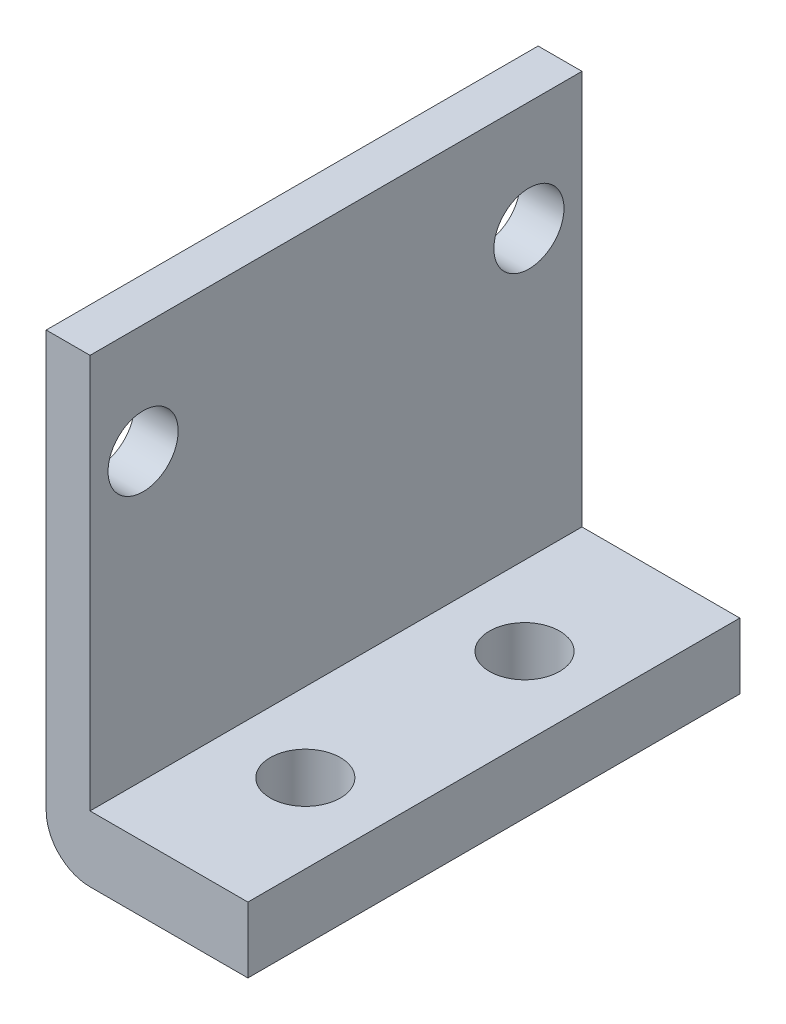
ISO-10303-21;
HEADER;
FILE_DESCRIPTION(('STEP AP214'),'2;1');
FILE_NAME('part.step','',(''),(''),'','','');
FILE_SCHEMA(('AUTOMOTIVE_DESIGN { 1 0 10303 214 1 1 1 1 }'));
ENDSEC;
DATA;
#1=APPLICATION_CONTEXT('core data for automotive mechanical design processes');
#2=APPLICATION_PROTOCOL_DEFINITION('international standard','automotive_design',2000,#1);
#3=PRODUCT_CONTEXT('',#1,'mechanical');
#4=PRODUCT('Part','Part','',(#3));
#5=PRODUCT_RELATED_PRODUCT_CATEGORY('part','',(#4));
#6=PRODUCT_DEFINITION_FORMATION('','',#4);
#7=PRODUCT_DEFINITION_CONTEXT('part definition',#1,'design');
#8=PRODUCT_DEFINITION('design','',#6,#7);
#9=PRODUCT_DEFINITION_SHAPE('','',#8);
#10=(LENGTH_UNIT() NAMED_UNIT(*) SI_UNIT(.MILLI.,.METRE.));
#11=(NAMED_UNIT(*) PLANE_ANGLE_UNIT() SI_UNIT($,.RADIAN.));
#12=(NAMED_UNIT(*) SI_UNIT($,.STERADIAN.) SOLID_ANGLE_UNIT());
#13=UNCERTAINTY_MEASURE_WITH_UNIT(LENGTH_MEASURE(1.E-05),#10,'distance_accuracy_value','');
#14=(GEOMETRIC_REPRESENTATION_CONTEXT(3) GLOBAL_UNCERTAINTY_ASSIGNED_CONTEXT((#13)) GLOBAL_UNIT_ASSIGNED_CONTEXT((#10,
#11,#12)) REPRESENTATION_CONTEXT('',''));
#15=CARTESIAN_POINT('',(0.,0.,0.));
#16=DIRECTION('',(0.,0.,1.));
#17=DIRECTION('',(1.,0.,0.));
#18=AXIS2_PLACEMENT_3D('',#15,#16,#17);
#19=CARTESIAN_POINT('',(0.,3.,0.));
#20=DIRECTION('',(0.,-1.,0.));
#21=DIRECTION('',(0.,0.,-1.));
#22=AXIS2_PLACEMENT_3D('',#19,#20,#21);
#23=PLANE('',#22);
#24=DIRECTION('',(-1.,0.,0.));
#25=VECTOR('',#24,1.);
#26=CARTESIAN_POINT('',(0.,3.,-22.44));
#27=LINE('',#26,#25);
#28=CARTESIAN_POINT('',(9.20000000000001,3.,-22.44));
#29=VERTEX_POINT('',#28);
#30=CARTESIAN_POINT('',(2.,3.,-22.44));
#31=VERTEX_POINT('',#30);
#32=EDGE_CURVE('E160',#29,#31,#27,.T.);
#33=ORIENTED_EDGE('',*,*,#32,.T.);
#34=DIRECTION('',(0.,0.,1.));
#35=VECTOR('',#34,1.);
#36=CARTESIAN_POINT('',(2.,3.,-22.44));
#37=LINE('',#36,#35);
#38=CARTESIAN_POINT('',(2.,3.,0.));
#39=VERTEX_POINT('',#38);
#40=EDGE_CURVE('E109',#31,#39,#37,.T.);
#41=ORIENTED_EDGE('',*,*,#40,.T.);
#42=DIRECTION('',(1.,0.,0.));
#43=VECTOR('',#42,1.);
#44=CARTESIAN_POINT('',(0.,3.,0.));
#45=LINE('',#44,#43);
#46=CARTESIAN_POINT('',(9.20000000000001,3.,0.));
#47=VERTEX_POINT('',#46);
#48=EDGE_CURVE('E115',#39,#47,#45,.T.);
#49=ORIENTED_EDGE('',*,*,#48,.T.);
#50=DIRECTION('',(0.,0.,-1.));
#51=VECTOR('',#50,1.);
#52=CARTESIAN_POINT('',(9.20000000000001,3.,0.));
#53=LINE('',#52,#51);
#54=EDGE_CURVE('E156',#47,#29,#53,.T.);
#55=ORIENTED_EDGE('',*,*,#54,.T.);
#56=EDGE_LOOP('',(#33,#41,#49,#55));
#57=FACE_BOUND('',#56,.T.);
#58=CARTESIAN_POINT('',(5.6,3.,-16.22));
#59=DIRECTION('',(0.,1.,0.));
#60=DIRECTION('',(0.,0.,1.));
#61=AXIS2_PLACEMENT_3D('',#58,#59,#60);
#62=CIRCLE('',#61,1.6);
#63=CARTESIAN_POINT('',(5.6,3.,-14.62));
#64=VERTEX_POINT('',#63);
#65=EDGE_CURVE('E146',#64,#64,#62,.T.);
#66=ORIENTED_EDGE('',*,*,#65,.F.);
#67=EDGE_LOOP('',(#66));
#68=FACE_BOUND('',#67,.T.);
#69=CARTESIAN_POINT('',(5.6,3.,-6.22));
#70=DIRECTION('',(0.,1.,0.));
#71=DIRECTION('',(0.,0.,1.));
#72=AXIS2_PLACEMENT_3D('',#69,#70,#71);
#73=CIRCLE('',#72,1.6);
#74=CARTESIAN_POINT('',(5.6,3.,-4.62));
#75=VERTEX_POINT('',#74);
#76=EDGE_CURVE('E138',#75,#75,#73,.T.);
#77=ORIENTED_EDGE('',*,*,#76,.F.);
#78=EDGE_LOOP('',(#77));
#79=FACE_BOUND('',#78,.T.);
#80=ADVANCED_FACE('F39',(#57,#68,#79),#23,.F.);
#81=CARTESIAN_POINT('',(0.,0.,0.));
#82=DIRECTION('',(0.,-1.,0.));
#83=DIRECTION('',(0.,0.,-1.));
#84=AXIS2_PLACEMENT_3D('',#81,#82,#83);
#85=PLANE('',#84);
#86=CARTESIAN_POINT('',(5.6,0.,-16.22));
#87=DIRECTION('',(0.,1.,0.));
#88=DIRECTION('',(0.,0.,1.));
#89=AXIS2_PLACEMENT_3D('',#86,#87,#88);
#90=CIRCLE('',#89,1.6);
#91=CARTESIAN_POINT('',(5.6,0.,-14.62));
#92=VERTEX_POINT('',#91);
#93=EDGE_CURVE('E142',#92,#92,#90,.T.);
#94=ORIENTED_EDGE('',*,*,#93,.T.);
#95=EDGE_LOOP('',(#94));
#96=FACE_BOUND('',#95,.T.);
#97=DIRECTION('',(1.,0.,0.));
#98=VECTOR('',#97,1.);
#99=CARTESIAN_POINT('',(0.,0.,0.));
#100=LINE('',#99,#98);
#101=CARTESIAN_POINT('',(2.,0.,0.));
#102=VERTEX_POINT('',#101);
#103=CARTESIAN_POINT('',(9.20000000000001,0.,0.));
#104=VERTEX_POINT('',#103);
#105=EDGE_CURVE('E150',#102,#104,#100,.T.);
#106=ORIENTED_EDGE('',*,*,#105,.F.);
#107=DIRECTION('',(0.,0.,1.));
#108=VECTOR('',#107,1.);
#109=CARTESIAN_POINT('',(2.,0.,-22.44));
#110=LINE('',#109,#108);
#111=CARTESIAN_POINT('',(2.,0.,-22.44));
#112=VERTEX_POINT('',#111);
#113=EDGE_CURVE('E48',#102,#112,#110,.F.);
#114=ORIENTED_EDGE('',*,*,#113,.T.);
#115=DIRECTION('',(-1.,0.,0.));
#116=VECTOR('',#115,1.);
#117=CARTESIAN_POINT('',(0.,0.,-22.44));
#118=LINE('',#117,#116);
#119=CARTESIAN_POINT('',(9.20000000000001,0.,-22.44));
#120=VERTEX_POINT('',#119);
#121=EDGE_CURVE('E157',#120,#112,#118,.T.);
#122=ORIENTED_EDGE('',*,*,#121,.F.);
#123=DIRECTION('',(0.,0.,-1.));
#124=VECTOR('',#123,1.);
#125=CARTESIAN_POINT('',(9.20000000000001,0.,0.));
#126=LINE('',#125,#124);
#127=EDGE_CURVE('E167',#104,#120,#126,.T.);
#128=ORIENTED_EDGE('',*,*,#127,.F.);
#129=EDGE_LOOP('',(#106,#114,#122,#128));
#130=FACE_BOUND('',#129,.T.);
#131=CARTESIAN_POINT('',(5.6,0.,-6.22));
#132=DIRECTION('',(0.,1.,0.));
#133=DIRECTION('',(0.,0.,1.));
#134=AXIS2_PLACEMENT_3D('',#131,#132,#133);
#135=CIRCLE('',#134,1.6);
#136=CARTESIAN_POINT('',(5.6,0.,-4.62));
#137=VERTEX_POINT('',#136);
#138=EDGE_CURVE('E120',#137,#137,#135,.T.);
#139=ORIENTED_EDGE('',*,*,#138,.T.);
#140=EDGE_LOOP('',(#139));
#141=FACE_BOUND('',#140,.T.);
#142=ADVANCED_FACE('F202',(#96,#130,#141),#85,.T.);
#143=CARTESIAN_POINT('',(0.,3.,0.));
#144=DIRECTION('',(1.,0.,0.));
#145=DIRECTION('',(0.,0.,-1.));
#146=AXIS2_PLACEMENT_3D('',#143,#144,#145);
#147=PLANE('',#146);
#148=CARTESIAN_POINT('',(0.,16.,-2.42000000000001));
#149=DIRECTION('',(1.,0.,0.));
#150=DIRECTION('',(0.,0.,-1.));
#151=AXIS2_PLACEMENT_3D('',#148,#149,#150);
#152=CIRCLE('',#151,1.6);
#153=CARTESIAN_POINT('',(0.,16.,-4.02000000000001));
#154=VERTEX_POINT('',#153);
#155=EDGE_CURVE('E135',#154,#154,#152,.T.);
#156=ORIENTED_EDGE('',*,*,#155,.T.);
#157=EDGE_LOOP('',(#156));
#158=FACE_BOUND('',#157,.T.);
#159=CARTESIAN_POINT('',(0.,16.,-20.02));
#160=DIRECTION('',(1.,0.,0.));
#161=DIRECTION('',(0.,0.,-1.));
#162=AXIS2_PLACEMENT_3D('',#159,#160,#161);
#163=CIRCLE('',#162,1.6);
#164=CARTESIAN_POINT('',(0.,16.,-21.62));
#165=VERTEX_POINT('',#164);
#166=EDGE_CURVE('E343',#165,#165,#163,.T.);
#167=ORIENTED_EDGE('',*,*,#166,.T.);
#168=EDGE_LOOP('',(#167));
#169=FACE_BOUND('',#168,.T.);
#170=DIRECTION('',(0.,-1.,0.));
#171=VECTOR('',#170,1.);
#172=CARTESIAN_POINT('',(0.,3.,-22.44));
#173=LINE('',#172,#171);
#174=CARTESIAN_POINT('',(0.,21.,-22.44));
#175=VERTEX_POINT('',#174);
#176=CARTESIAN_POINT('',(0.,2.,-22.44));
#177=VERTEX_POINT('',#176);
#178=EDGE_CURVE('E164',#175,#177,#173,.T.);
#179=ORIENTED_EDGE('',*,*,#178,.T.);
#180=DIRECTION('',(0.,0.,1.));
#181=VECTOR('',#180,1.);
#182=CARTESIAN_POINT('',(0.,2.,0.));
#183=LINE('',#182,#181);
#184=CARTESIAN_POINT('',(0.,2.,0.));
#185=VERTEX_POINT('',#184);
#186=EDGE_CURVE('E186',#177,#185,#183,.T.);
#187=ORIENTED_EDGE('',*,*,#186,.T.);
#188=DIRECTION('',(0.,-1.,0.));
#189=VECTOR('',#188,1.);
#190=CARTESIAN_POINT('',(0.,3.,0.));
#191=LINE('',#190,#189);
#192=CARTESIAN_POINT('',(0.,21.,0.));
#193=VERTEX_POINT('',#192);
#194=EDGE_CURVE('E183',#193,#185,#191,.T.);
#195=ORIENTED_EDGE('',*,*,#194,.F.);
#196=DIRECTION('',(0.,0.,1.));
#197=VECTOR('',#196,1.);
#198=CARTESIAN_POINT('',(0.,21.,-22.44));
#199=LINE('',#198,#197);
#200=EDGE_CURVE('E107',#175,#193,#199,.T.);
#201=ORIENTED_EDGE('',*,*,#200,.F.);
#202=EDGE_LOOP('',(#179,#187,#195,#201));
#203=FACE_BOUND('',#202,.T.);
#204=ADVANCED_FACE('F194',(#158,#169,#203),#147,.F.);
#205=CARTESIAN_POINT('',(0.,3.,0.));
#206=DIRECTION('',(0.,0.,-1.));
#207=DIRECTION('',(-1.,0.,0.));
#208=AXIS2_PLACEMENT_3D('',#205,#206,#207);
#209=PLANE('',#208);
#210=ORIENTED_EDGE('',*,*,#194,.T.);
#211=CARTESIAN_POINT('',(2.,2.,0.));
#212=DIRECTION('',(0.,0.,-1.));
#213=DIRECTION('',(-1.,0.,0.));
#214=AXIS2_PLACEMENT_3D('',#211,#212,#213);
#215=CIRCLE('',#214,2.);
#216=EDGE_CURVE('E62',#185,#102,#215,.F.);
#217=ORIENTED_EDGE('',*,*,#216,.T.);
#218=ORIENTED_EDGE('',*,*,#105,.T.);
#219=DIRECTION('',(0.,-1.,0.));
#220=VECTOR('',#219,1.);
#221=CARTESIAN_POINT('',(9.20000000000001,3.,0.));
#222=LINE('',#221,#220);
#223=EDGE_CURVE('E179',#47,#104,#222,.T.);
#224=ORIENTED_EDGE('',*,*,#223,.F.);
#225=ORIENTED_EDGE('',*,*,#48,.F.);
#226=DIRECTION('',(0.,-1.,0.));
#227=VECTOR('',#226,1.);
#228=CARTESIAN_POINT('',(2.,21.,0.));
#229=LINE('',#228,#227);
#230=CARTESIAN_POINT('',(2.,21.,0.));
#231=VERTEX_POINT('',#230);
#232=EDGE_CURVE('E112',#231,#39,#229,.T.);
#233=ORIENTED_EDGE('',*,*,#232,.F.);
#234=DIRECTION('',(1.,0.,0.));
#235=VECTOR('',#234,1.);
#236=CARTESIAN_POINT('',(0.,21.,0.));
#237=LINE('',#236,#235);
#238=EDGE_CURVE('E99',#193,#231,#237,.T.);
#239=ORIENTED_EDGE('',*,*,#238,.F.);
#240=EDGE_LOOP('',(#210,#217,#218,#224,#225,#233,#239));
#241=FACE_BOUND('',#240,.T.);
#242=ADVANCED_FACE('F113',(#241),#209,.F.);
#243=CARTESIAN_POINT('',(9.20000000000001,3.,0.));
#244=DIRECTION('',(-1.,0.,0.));
#245=DIRECTION('',(0.,0.,1.));
#246=AXIS2_PLACEMENT_3D('',#243,#244,#245);
#247=PLANE('',#246);
#248=ORIENTED_EDGE('',*,*,#127,.T.);
#249=DIRECTION('',(0.,-1.,0.));
#250=VECTOR('',#249,1.);
#251=CARTESIAN_POINT('',(9.20000000000001,3.,-22.44));
#252=LINE('',#251,#250);
#253=EDGE_CURVE('E175',#29,#120,#252,.T.);
#254=ORIENTED_EDGE('',*,*,#253,.F.);
#255=ORIENTED_EDGE('',*,*,#54,.F.);
#256=ORIENTED_EDGE('',*,*,#223,.T.);
#257=EDGE_LOOP('',(#248,#254,#255,#256));
#258=FACE_BOUND('',#257,.T.);
#259=ADVANCED_FACE('F205',(#258),#247,.F.);
#260=CARTESIAN_POINT('',(0.,3.,-22.44));
#261=DIRECTION('',(0.,0.,1.));
#262=DIRECTION('',(1.,0.,0.));
#263=AXIS2_PLACEMENT_3D('',#260,#261,#262);
#264=PLANE('',#263);
#265=ORIENTED_EDGE('',*,*,#121,.T.);
#266=CARTESIAN_POINT('',(2.,2.,-22.44));
#267=DIRECTION('',(0.,0.,1.));
#268=DIRECTION('',(1.,0.,0.));
#269=AXIS2_PLACEMENT_3D('',#266,#267,#268);
#270=CIRCLE('',#269,2.);
#271=EDGE_CURVE('E11',#112,#177,#270,.F.);
#272=ORIENTED_EDGE('',*,*,#271,.T.);
#273=ORIENTED_EDGE('',*,*,#178,.F.);
#274=DIRECTION('',(1.,0.,0.));
#275=VECTOR('',#274,1.);
#276=CARTESIAN_POINT('',(0.,21.,-22.44));
#277=LINE('',#276,#275);
#278=CARTESIAN_POINT('',(2.,21.,-22.44));
#279=VERTEX_POINT('',#278);
#280=EDGE_CURVE('E125',#175,#279,#277,.T.);
#281=ORIENTED_EDGE('',*,*,#280,.T.);
#282=DIRECTION('',(0.,-1.,0.));
#283=VECTOR('',#282,1.);
#284=CARTESIAN_POINT('',(2.,21.,-22.44));
#285=LINE('',#284,#283);
#286=EDGE_CURVE('E121',#279,#31,#285,.T.);
#287=ORIENTED_EDGE('',*,*,#286,.T.);
#288=ORIENTED_EDGE('',*,*,#32,.F.);
#289=ORIENTED_EDGE('',*,*,#253,.T.);
#290=EDGE_LOOP('',(#265,#272,#273,#281,#287,#288,#289));
#291=FACE_BOUND('',#290,.T.);
#292=ADVANCED_FACE('F198',(#291),#264,.F.);
#293=CARTESIAN_POINT('',(5.6,3.,-16.22));
#294=DIRECTION('',(0.,-1.,0.));
#295=DIRECTION('',(0.,0.,-1.));
#296=AXIS2_PLACEMENT_3D('',#293,#294,#295);
#297=CYLINDRICAL_SURFACE('',#296,1.6);
#298=ORIENTED_EDGE('',*,*,#65,.T.);
#299=EDGE_LOOP('',(#298));
#300=FACE_BOUND('',#299,.T.);
#301=ORIENTED_EDGE('',*,*,#93,.F.);
#302=EDGE_LOOP('',(#301));
#303=FACE_BOUND('',#302,.T.);
#304=ADVANCED_FACE('F218',(#300,#303),#297,.F.);
#305=CARTESIAN_POINT('',(5.6,3.,-6.22));
#306=DIRECTION('',(0.,-1.,0.));
#307=DIRECTION('',(0.,0.,-1.));
#308=AXIS2_PLACEMENT_3D('',#305,#306,#307);
#309=CYLINDRICAL_SURFACE('',#308,1.6);
#310=ORIENTED_EDGE('',*,*,#76,.T.);
#311=EDGE_LOOP('',(#310));
#312=FACE_BOUND('',#311,.T.);
#313=ORIENTED_EDGE('',*,*,#138,.F.);
#314=EDGE_LOOP('',(#313));
#315=FACE_BOUND('',#314,.T.);
#316=ADVANCED_FACE('F215',(#312,#315),#309,.F.);
#317=CARTESIAN_POINT('',(2.,21.,-22.44));
#318=DIRECTION('',(1.,0.,0.));
#319=DIRECTION('',(0.,0.,-1.));
#320=AXIS2_PLACEMENT_3D('',#317,#318,#319);
#321=PLANE('',#320);
#322=CARTESIAN_POINT('',(2.,16.,-2.42000000000001));
#323=DIRECTION('',(1.,0.,0.));
#324=DIRECTION('',(0.,0.,-1.));
#325=AXIS2_PLACEMENT_3D('',#322,#323,#324);
#326=CIRCLE('',#325,1.6);
#327=CARTESIAN_POINT('',(2.,16.,-4.02000000000001));
#328=VERTEX_POINT('',#327);
#329=EDGE_CURVE('E339',#328,#328,#326,.T.);
#330=ORIENTED_EDGE('',*,*,#329,.F.);
#331=EDGE_LOOP('',(#330));
#332=FACE_BOUND('',#331,.T.);
#333=CARTESIAN_POINT('',(2.,16.,-20.02));
#334=DIRECTION('',(1.,0.,0.));
#335=DIRECTION('',(0.,0.,-1.));
#336=AXIS2_PLACEMENT_3D('',#333,#334,#335);
#337=CIRCLE('',#336,1.6);
#338=CARTESIAN_POINT('',(2.,16.,-21.62));
#339=VERTEX_POINT('',#338);
#340=EDGE_CURVE('E348',#339,#339,#337,.T.);
#341=ORIENTED_EDGE('',*,*,#340,.F.);
#342=EDGE_LOOP('',(#341));
#343=FACE_BOUND('',#342,.T.);
#344=ORIENTED_EDGE('',*,*,#40,.F.);
#345=ORIENTED_EDGE('',*,*,#286,.F.);
#346=DIRECTION('',(0.,0.,1.));
#347=VECTOR('',#346,1.);
#348=CARTESIAN_POINT('',(2.,21.,-22.44));
#349=LINE('',#348,#347);
#350=EDGE_CURVE('E104',#279,#231,#349,.T.);
#351=ORIENTED_EDGE('',*,*,#350,.T.);
#352=ORIENTED_EDGE('',*,*,#232,.T.);
#353=EDGE_LOOP('',(#344,#345,#351,#352));
#354=FACE_BOUND('',#353,.T.);
#355=ADVANCED_FACE('F123',(#332,#343,#354),#321,.T.);
#356=CARTESIAN_POINT('',(0.,21.,0.));
#357=DIRECTION('',(0.,-1.,0.));
#358=DIRECTION('',(0.,0.,-1.));
#359=AXIS2_PLACEMENT_3D('',#356,#357,#358);
#360=PLANE('',#359);
#361=ORIENTED_EDGE('',*,*,#238,.T.);
#362=ORIENTED_EDGE('',*,*,#350,.F.);
#363=ORIENTED_EDGE('',*,*,#280,.F.);
#364=ORIENTED_EDGE('',*,*,#200,.T.);
#365=EDGE_LOOP('',(#361,#362,#363,#364));
#366=FACE_BOUND('',#365,.T.);
#367=ADVANCED_FACE('F101',(#366),#360,.F.);
#368=CARTESIAN_POINT('',(2.,2.,0.));
#369=DIRECTION('',(0.,0.,-1.));
#370=DIRECTION('',(-1.,0.,0.));
#371=AXIS2_PLACEMENT_3D('',#368,#369,#370);
#372=CYLINDRICAL_SURFACE('',#371,2.);
#373=ORIENTED_EDGE('',*,*,#271,.F.);
#374=ORIENTED_EDGE('',*,*,#113,.F.);
#375=ORIENTED_EDGE('',*,*,#216,.F.);
#376=ORIENTED_EDGE('',*,*,#186,.F.);
#377=EDGE_LOOP('',(#373,#374,#375,#376));
#378=FACE_BOUND('',#377,.T.);
#379=ADVANCED_FACE('F41',(#378),#372,.T.);
#380=CARTESIAN_POINT('',(-16.,16.,-20.02));
#381=DIRECTION('',(1.,0.,0.));
#382=DIRECTION('',(0.,0.,-1.));
#383=AXIS2_PLACEMENT_3D('',#380,#381,#382);
#384=CYLINDRICAL_SURFACE('',#383,1.6);
#385=ORIENTED_EDGE('',*,*,#340,.T.);
#386=EDGE_LOOP('',(#385));
#387=FACE_BOUND('',#386,.T.);
#388=ORIENTED_EDGE('',*,*,#166,.F.);
#389=EDGE_LOOP('',(#388));
#390=FACE_BOUND('',#389,.T.);
#391=ADVANCED_FACE('F278',(#387,#390),#384,.F.);
#392=CARTESIAN_POINT('',(-16.,16.,-2.42000000000001));
#393=DIRECTION('',(1.,0.,0.));
#394=DIRECTION('',(0.,0.,-1.));
#395=AXIS2_PLACEMENT_3D('',#392,#393,#394);
#396=CYLINDRICAL_SURFACE('',#395,1.6);
#397=ORIENTED_EDGE('',*,*,#329,.T.);
#398=EDGE_LOOP('',(#397));
#399=FACE_BOUND('',#398,.T.);
#400=ORIENTED_EDGE('',*,*,#155,.F.);
#401=EDGE_LOOP('',(#400));
#402=FACE_BOUND('',#401,.T.);
#403=ADVANCED_FACE('F283',(#399,#402),#396,.F.);
#404=CLOSED_SHELL('',(#80,#142,#204,#242,#259,#292,#304,#316,#355,#367,#379,#391,#403));
#405=MANIFOLD_SOLID_BREP('B2',#404);
#406=ADVANCED_BREP_SHAPE_REPRESENTATION('',(#18,#405),#14);
#407=SHAPE_DEFINITION_REPRESENTATION(#9,#406);
ENDSEC;
END-ISO-10303-21;
